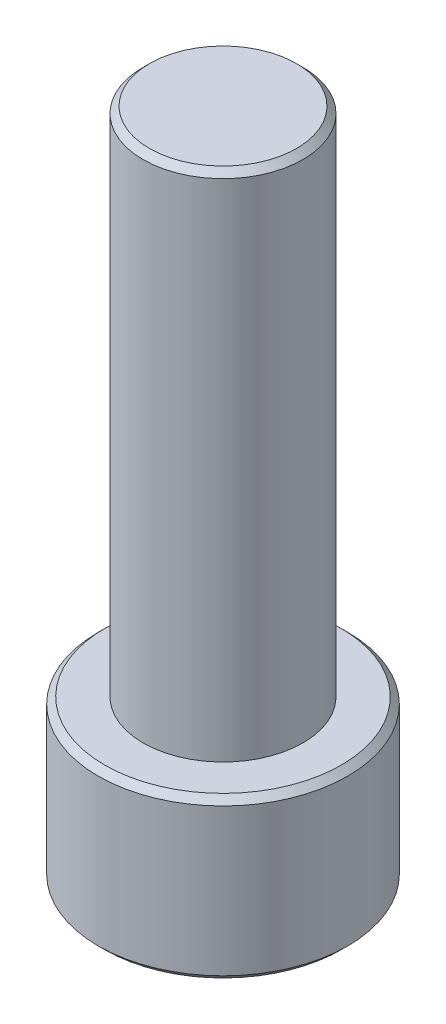
ISO-10303-21;
HEADER;
FILE_DESCRIPTION(('STEP AP214'),'2;1');
FILE_NAME('part.step','',(''),(''),'','','');
FILE_SCHEMA(('AUTOMOTIVE_DESIGN { 1 0 10303 214 1 1 1 1 }'));
ENDSEC;
DATA;
#1=APPLICATION_CONTEXT('core data for automotive mechanical design processes');
#2=APPLICATION_PROTOCOL_DEFINITION('international standard','automotive_design',2000,#1);
#3=PRODUCT_CONTEXT('',#1,'mechanical');
#4=PRODUCT('Part','Part','',(#3));
#5=PRODUCT_RELATED_PRODUCT_CATEGORY('part','',(#4));
#6=PRODUCT_DEFINITION_FORMATION('','',#4);
#7=PRODUCT_DEFINITION_CONTEXT('part definition',#1,'design');
#8=PRODUCT_DEFINITION('design','',#6,#7);
#9=PRODUCT_DEFINITION_SHAPE('','',#8);
#10=(LENGTH_UNIT() NAMED_UNIT(*) SI_UNIT(.MILLI.,.METRE.));
#11=(NAMED_UNIT(*) PLANE_ANGLE_UNIT() SI_UNIT($,.RADIAN.));
#12=(NAMED_UNIT(*) SI_UNIT($,.STERADIAN.) SOLID_ANGLE_UNIT());
#13=UNCERTAINTY_MEASURE_WITH_UNIT(LENGTH_MEASURE(1.E-05),#10,'distance_accuracy_value','');
#14=(GEOMETRIC_REPRESENTATION_CONTEXT(3) GLOBAL_UNCERTAINTY_ASSIGNED_CONTEXT((#13)) GLOBAL_UNIT_ASSIGNED_CONTEXT((#10,
#11,#12)) REPRESENTATION_CONTEXT('',''));
#15=CARTESIAN_POINT('',(0.,0.,0.));
#16=DIRECTION('',(0.,0.,1.));
#17=DIRECTION('',(1.,0.,0.));
#18=AXIS2_PLACEMENT_3D('',#15,#16,#17);
#19=CARTESIAN_POINT('',(0.,0.,0.));
#20=DIRECTION('',(0.,1.,0.));
#21=DIRECTION('',(0.,0.,1.));
#22=AXIS2_PLACEMENT_3D('',#19,#20,#21);
#23=PLANE('',#22);
#24=CARTESIAN_POINT('',(0.,0.,0.));
#25=DIRECTION('',(0.,1.,0.));
#26=DIRECTION('',(0.,0.,1.));
#27=AXIS2_PLACEMENT_3D('',#24,#25,#26);
#28=CIRCLE('',#27,1.85);
#29=CARTESIAN_POINT('',(0.,0.,1.85));
#30=VERTEX_POINT('',#29);
#31=EDGE_CURVE('E153',#30,#30,#28,.T.);
#32=ORIENTED_EDGE('',*,*,#31,.T.);
#33=EDGE_LOOP('',(#32));
#34=FACE_BOUND('',#33,.T.);
#35=CARTESIAN_POINT('',(0.,0.,0.));
#36=DIRECTION('',(0.,1.,0.));
#37=DIRECTION('',(0.,0.,1.));
#38=AXIS2_PLACEMENT_3D('',#35,#36,#37);
#39=CIRCLE('',#38,1.25);
#40=CARTESIAN_POINT('',(0.,0.,1.25));
#41=VERTEX_POINT('',#40);
#42=EDGE_CURVE('E139',#41,#41,#39,.T.);
#43=ORIENTED_EDGE('',*,*,#42,.F.);
#44=EDGE_LOOP('',(#43));
#45=FACE_BOUND('',#44,.T.);
#46=ADVANCED_FACE('F37',(#34,#45),#23,.T.);
#47=CARTESIAN_POINT('',(0.,-2.5,0.));
#48=DIRECTION('',(0.,1.,0.));
#49=DIRECTION('',(0.,0.,1.));
#50=AXIS2_PLACEMENT_3D('',#47,#48,#49);
#51=CYLINDRICAL_SURFACE('',#50,1.95);
#52=CARTESIAN_POINT('',(0.,-0.099999999999999,0.));
#53=DIRECTION('',(0.,1.,0.));
#54=DIRECTION('',(0.,0.,1.));
#55=AXIS2_PLACEMENT_3D('',#52,#53,#54);
#56=CIRCLE('',#55,1.95);
#57=CARTESIAN_POINT('',(0.,-0.099999999999999,1.95));
#58=VERTEX_POINT('',#57);
#59=EDGE_CURVE('E45',#58,#58,#56,.F.);
#60=ORIENTED_EDGE('',*,*,#59,.T.);
#61=EDGE_LOOP('',(#60));
#62=FACE_BOUND('',#61,.T.);
#63=CARTESIAN_POINT('',(0.,-2.4,0.));
#64=DIRECTION('',(0.,1.,0.));
#65=DIRECTION('',(0.,0.,1.));
#66=AXIS2_PLACEMENT_3D('',#63,#64,#65);
#67=CIRCLE('',#66,1.95);
#68=CARTESIAN_POINT('',(0.,-2.4,1.95));
#69=VERTEX_POINT('',#68);
#70=EDGE_CURVE('E156',#69,#69,#67,.T.);
#71=ORIENTED_EDGE('',*,*,#70,.T.);
#72=EDGE_LOOP('',(#71));
#73=FACE_BOUND('',#72,.T.);
#74=ADVANCED_FACE('F161',(#62,#73),#51,.T.);
#75=CARTESIAN_POINT('',(0.,-2.5,0.));
#76=DIRECTION('',(0.,1.,0.));
#77=DIRECTION('',(0.,0.,1.));
#78=AXIS2_PLACEMENT_3D('',#75,#76,#77);
#79=PLANE('',#78);
#80=CARTESIAN_POINT('',(0.,-2.5,0.));
#81=DIRECTION('',(0.,1.,0.));
#82=DIRECTION('',(0.,0.,1.));
#83=AXIS2_PLACEMENT_3D('',#80,#81,#82);
#84=CIRCLE('',#83,1.85);
#85=CARTESIAN_POINT('',(0.,-2.5,1.85));
#86=VERTEX_POINT('',#85);
#87=EDGE_CURVE('E11',#86,#86,#84,.F.);
#88=ORIENTED_EDGE('',*,*,#87,.T.);
#89=EDGE_LOOP('',(#88));
#90=FACE_BOUND('',#89,.T.);
#91=DIRECTION('',(0.866025403784439,0.,0.5));
#92=VECTOR('',#91,1.);
#93=CARTESIAN_POINT('',(-0.999999999999999,-2.5,0.577350269189626));
#94=LINE('',#93,#92);
#95=CARTESIAN_POINT('',(-0.999999999999999,-2.5,0.577350269189626));
#96=VERTEX_POINT('',#95);
#97=CARTESIAN_POINT('',(0.,-2.5,1.15470053837925));
#98=VERTEX_POINT('',#97);
#99=EDGE_CURVE('E114',#96,#98,#94,.T.);
#100=ORIENTED_EDGE('',*,*,#99,.T.);
#101=DIRECTION('',(0.866025403784439,0.,-0.5));
#102=VECTOR('',#101,1.);
#103=CARTESIAN_POINT('',(0.,-2.5,1.15470053837925));
#104=LINE('',#103,#102);
#105=CARTESIAN_POINT('',(0.999999999999999,-2.5,0.577350269189626));
#106=VERTEX_POINT('',#105);
#107=EDGE_CURVE('E137',#98,#106,#104,.T.);
#108=ORIENTED_EDGE('',*,*,#107,.T.);
#109=DIRECTION('',(0.,0.,-1.));
#110=VECTOR('',#109,1.);
#111=CARTESIAN_POINT('',(0.999999999999999,-2.5,0.577350269189626));
#112=LINE('',#111,#110);
#113=CARTESIAN_POINT('',(0.999999999999999,-2.5,-0.577350269189627));
#114=VERTEX_POINT('',#113);
#115=EDGE_CURVE('E119',#106,#114,#112,.T.);
#116=ORIENTED_EDGE('',*,*,#115,.T.);
#117=DIRECTION('',(-0.866025403784439,0.,-0.5));
#118=VECTOR('',#117,1.);
#119=CARTESIAN_POINT('',(0.999999999999999,-2.5,-0.577350269189627));
#120=LINE('',#119,#118);
#121=CARTESIAN_POINT('',(0.,-2.5,-1.15470053837925));
#122=VERTEX_POINT('',#121);
#123=EDGE_CURVE('E52',#114,#122,#120,.T.);
#124=ORIENTED_EDGE('',*,*,#123,.T.);
#125=DIRECTION('',(-0.866025403784439,0.,0.5));
#126=VECTOR('',#125,1.);
#127=CARTESIAN_POINT('',(0.,-2.5,-1.15470053837925));
#128=LINE('',#127,#126);
#129=CARTESIAN_POINT('',(-1.,-2.5,-0.577350269189626));
#130=VERTEX_POINT('',#129);
#131=EDGE_CURVE('E100',#122,#130,#128,.T.);
#132=ORIENTED_EDGE('',*,*,#131,.T.);
#133=DIRECTION('',(0.,0.,1.));
#134=VECTOR('',#133,1.);
#135=CARTESIAN_POINT('',(-1.,-2.5,-0.577350269189626));
#136=LINE('',#135,#134);
#137=EDGE_CURVE('E110',#130,#96,#136,.T.);
#138=ORIENTED_EDGE('',*,*,#137,.T.);
#139=EDGE_LOOP('',(#100,#108,#116,#124,#132,#138));
#140=FACE_BOUND('',#139,.T.);
#141=ADVANCED_FACE('F116',(#90,#140),#79,.F.);
#142=CARTESIAN_POINT('',(0.,8.,0.));
#143=DIRECTION('',(0.,-1.,0.));
#144=DIRECTION('',(0.,0.,-1.));
#145=AXIS2_PLACEMENT_3D('',#142,#143,#144);
#146=CYLINDRICAL_SURFACE('',#145,1.25);
#147=CARTESIAN_POINT('',(0.,7.9,0.));
#148=DIRECTION('',(0.,1.,0.));
#149=DIRECTION('',(0.,0.,1.));
#150=AXIS2_PLACEMENT_3D('',#147,#148,#149);
#151=CIRCLE('',#150,1.25);
#152=CARTESIAN_POINT('',(0.,7.9,1.25));
#153=VERTEX_POINT('',#152);
#154=EDGE_CURVE('E150',#153,#153,#151,.F.);
#155=ORIENTED_EDGE('',*,*,#154,.T.);
#156=EDGE_LOOP('',(#155));
#157=FACE_BOUND('',#156,.T.);
#158=ORIENTED_EDGE('',*,*,#42,.T.);
#159=EDGE_LOOP('',(#158));
#160=FACE_BOUND('',#159,.T.);
#161=ADVANCED_FACE('F175',(#157,#160),#146,.T.);
#162=CARTESIAN_POINT('',(0.,8.,0.));
#163=DIRECTION('',(0.,1.,0.));
#164=DIRECTION('',(0.,0.,1.));
#165=AXIS2_PLACEMENT_3D('',#162,#163,#164);
#166=PLANE('',#165);
#167=CARTESIAN_POINT('',(0.,8.,0.));
#168=DIRECTION('',(0.,1.,0.));
#169=DIRECTION('',(0.,0.,1.));
#170=AXIS2_PLACEMENT_3D('',#167,#168,#169);
#171=CIRCLE('',#170,1.15);
#172=CARTESIAN_POINT('',(0.,8.,1.15));
#173=VERTEX_POINT('',#172);
#174=EDGE_CURVE('E147',#173,#173,#171,.T.);
#175=ORIENTED_EDGE('',*,*,#174,.T.);
#176=EDGE_LOOP('',(#175));
#177=FACE_BOUND('',#176,.T.);
#178=ADVANCED_FACE('F177',(#177),#166,.T.);
#179=CARTESIAN_POINT('',(0.,-2.5,1.15470053837925));
#180=DIRECTION('',(0.5,0.,0.866025403784439));
#181=DIRECTION('',(0.866025403784439,0.,-0.5));
#182=AXIS2_PLACEMENT_3D('',#179,#180,#181);
#183=PLANE('',#182);
#184=DIRECTION('',(0.866025403784439,0.,-0.5));
#185=VECTOR('',#184,1.);
#186=CARTESIAN_POINT('',(0.,-1.25,1.15470053837925));
#187=LINE('',#186,#185);
#188=CARTESIAN_POINT('',(0.,-1.25,1.15470053837925));
#189=VERTEX_POINT('',#188);
#190=CARTESIAN_POINT('',(0.999999999999999,-1.25,0.577350269189626));
#191=VERTEX_POINT('',#190);
#192=EDGE_CURVE('E124',#189,#191,#187,.T.);
#193=ORIENTED_EDGE('',*,*,#192,.T.);
#194=DIRECTION('',(0.,1.,0.));
#195=VECTOR('',#194,1.);
#196=CARTESIAN_POINT('',(0.999999999999999,-2.5,0.577350269189626));
#197=LINE('',#196,#195);
#198=EDGE_CURVE('E89',#106,#191,#197,.T.);
#199=ORIENTED_EDGE('',*,*,#198,.F.);
#200=ORIENTED_EDGE('',*,*,#107,.F.);
#201=DIRECTION('',(0.,1.,0.));
#202=VECTOR('',#201,1.);
#203=CARTESIAN_POINT('',(0.,-2.5,1.15470053837925));
#204=LINE('',#203,#202);
#205=EDGE_CURVE('E61',#98,#189,#204,.T.);
#206=ORIENTED_EDGE('',*,*,#205,.T.);
#207=EDGE_LOOP('',(#193,#199,#200,#206));
#208=FACE_BOUND('',#207,.T.);
#209=ADVANCED_FACE('F184',(#208),#183,.F.);
#210=CARTESIAN_POINT('',(-0.999999999999999,-2.5,0.577350269189626));
#211=DIRECTION('',(-0.5,0.,0.866025403784439));
#212=DIRECTION('',(0.866025403784439,0.,0.5));
#213=AXIS2_PLACEMENT_3D('',#210,#211,#212);
#214=PLANE('',#213);
#215=DIRECTION('',(0.866025403784439,0.,0.5));
#216=VECTOR('',#215,1.);
#217=CARTESIAN_POINT('',(-0.999999999999999,-1.25,0.577350269189626));
#218=LINE('',#217,#216);
#219=CARTESIAN_POINT('',(-0.999999999999999,-1.25,0.577350269189626));
#220=VERTEX_POINT('',#219);
#221=EDGE_CURVE('E135',#220,#189,#218,.T.);
#222=ORIENTED_EDGE('',*,*,#221,.T.);
#223=ORIENTED_EDGE('',*,*,#205,.F.);
#224=ORIENTED_EDGE('',*,*,#99,.F.);
#225=DIRECTION('',(0.,1.,0.));
#226=VECTOR('',#225,1.);
#227=CARTESIAN_POINT('',(-0.999999999999999,-2.5,0.577350269189626));
#228=LINE('',#227,#226);
#229=EDGE_CURVE('E106',#96,#220,#228,.T.);
#230=ORIENTED_EDGE('',*,*,#229,.T.);
#231=EDGE_LOOP('',(#222,#223,#224,#230));
#232=FACE_BOUND('',#231,.T.);
#233=ADVANCED_FACE('F212',(#232),#214,.F.);
#234=CARTESIAN_POINT('',(-1.,-2.5,-0.577350269189626));
#235=DIRECTION('',(-1.,0.,0.));
#236=DIRECTION('',(0.,0.,1.));
#237=AXIS2_PLACEMENT_3D('',#234,#235,#236);
#238=PLANE('',#237);
#239=DIRECTION('',(0.,0.,1.));
#240=VECTOR('',#239,1.);
#241=CARTESIAN_POINT('',(-1.,-1.25,-0.577350269189626));
#242=LINE('',#241,#240);
#243=CARTESIAN_POINT('',(-1.,-1.25,-0.577350269189626));
#244=VERTEX_POINT('',#243);
#245=EDGE_CURVE('E133',#244,#220,#242,.T.);
#246=ORIENTED_EDGE('',*,*,#245,.T.);
#247=ORIENTED_EDGE('',*,*,#229,.F.);
#248=ORIENTED_EDGE('',*,*,#137,.F.);
#249=DIRECTION('',(0.,1.,0.));
#250=VECTOR('',#249,1.);
#251=CARTESIAN_POINT('',(-1.,-2.5,-0.577350269189626));
#252=LINE('',#251,#250);
#253=EDGE_CURVE('E96',#130,#244,#252,.T.);
#254=ORIENTED_EDGE('',*,*,#253,.T.);
#255=EDGE_LOOP('',(#246,#247,#248,#254));
#256=FACE_BOUND('',#255,.T.);
#257=ADVANCED_FACE('F111',(#256),#238,.F.);
#258=CARTESIAN_POINT('',(0.,-2.5,-1.15470053837925));
#259=DIRECTION('',(-0.5,0.,-0.866025403784438));
#260=DIRECTION('',(-0.866025403784438,0.,0.5));
#261=AXIS2_PLACEMENT_3D('',#258,#259,#260);
#262=PLANE('',#261);
#263=DIRECTION('',(-0.866025403784439,0.,0.5));
#264=VECTOR('',#263,1.);
#265=CARTESIAN_POINT('',(0.,-1.25,-1.15470053837925));
#266=LINE('',#265,#264);
#267=CARTESIAN_POINT('',(0.,-1.25,-1.15470053837925));
#268=VERTEX_POINT('',#267);
#269=EDGE_CURVE('E102',#268,#244,#266,.T.);
#270=ORIENTED_EDGE('',*,*,#269,.T.);
#271=ORIENTED_EDGE('',*,*,#253,.F.);
#272=ORIENTED_EDGE('',*,*,#131,.F.);
#273=DIRECTION('',(0.,1.,0.));
#274=VECTOR('',#273,1.);
#275=CARTESIAN_POINT('',(0.,-2.5,-1.15470053837925));
#276=LINE('',#275,#274);
#277=EDGE_CURVE('E107',#122,#268,#276,.T.);
#278=ORIENTED_EDGE('',*,*,#277,.T.);
#279=EDGE_LOOP('',(#270,#271,#272,#278));
#280=FACE_BOUND('',#279,.T.);
#281=ADVANCED_FACE('F98',(#280),#262,.F.);
#282=CARTESIAN_POINT('',(0.999999999999999,-2.5,-0.577350269189627));
#283=DIRECTION('',(0.5,0.,-0.866025403784439));
#284=DIRECTION('',(-0.866025403784439,0.,-0.5));
#285=AXIS2_PLACEMENT_3D('',#282,#283,#284);
#286=PLANE('',#285);
#287=DIRECTION('',(-0.866025403784439,0.,-0.5));
#288=VECTOR('',#287,1.);
#289=CARTESIAN_POINT('',(0.999999999999999,-1.25,-0.577350269189627));
#290=LINE('',#289,#288);
#291=CARTESIAN_POINT('',(0.999999999999999,-1.25,-0.577350269189627));
#292=VERTEX_POINT('',#291);
#293=EDGE_CURVE('E129',#292,#268,#290,.T.);
#294=ORIENTED_EDGE('',*,*,#293,.T.);
#295=ORIENTED_EDGE('',*,*,#277,.F.);
#296=ORIENTED_EDGE('',*,*,#123,.F.);
#297=DIRECTION('',(0.,1.,0.));
#298=VECTOR('',#297,1.);
#299=CARTESIAN_POINT('',(0.999999999999999,-2.5,-0.577350269189627));
#300=LINE('',#299,#298);
#301=EDGE_CURVE('E142',#114,#292,#300,.T.);
#302=ORIENTED_EDGE('',*,*,#301,.T.);
#303=EDGE_LOOP('',(#294,#295,#296,#302));
#304=FACE_BOUND('',#303,.T.);
#305=ADVANCED_FACE('F208',(#304),#286,.F.);
#306=CARTESIAN_POINT('',(0.999999999999999,-2.5,0.577350269189626));
#307=DIRECTION('',(1.,0.,0.));
#308=DIRECTION('',(0.,0.,-1.));
#309=AXIS2_PLACEMENT_3D('',#306,#307,#308);
#310=PLANE('',#309);
#311=DIRECTION('',(0.,0.,-1.));
#312=VECTOR('',#311,1.);
#313=CARTESIAN_POINT('',(0.999999999999999,-1.25,0.577350269189626));
#314=LINE('',#313,#312);
#315=EDGE_CURVE('E126',#191,#292,#314,.T.);
#316=ORIENTED_EDGE('',*,*,#315,.T.);
#317=ORIENTED_EDGE('',*,*,#301,.F.);
#318=ORIENTED_EDGE('',*,*,#115,.F.);
#319=ORIENTED_EDGE('',*,*,#198,.T.);
#320=EDGE_LOOP('',(#316,#317,#318,#319));
#321=FACE_BOUND('',#320,.T.);
#322=ADVANCED_FACE('F199',(#321),#310,.F.);
#323=CARTESIAN_POINT('',(0.,-1.25,0.));
#324=DIRECTION('',(0.,1.,0.));
#325=DIRECTION('',(0.,0.,1.));
#326=AXIS2_PLACEMENT_3D('',#323,#324,#325);
#327=PLANE('',#326);
#328=ORIENTED_EDGE('',*,*,#192,.F.);
#329=ORIENTED_EDGE('',*,*,#221,.F.);
#330=ORIENTED_EDGE('',*,*,#245,.F.);
#331=ORIENTED_EDGE('',*,*,#269,.F.);
#332=ORIENTED_EDGE('',*,*,#293,.F.);
#333=ORIENTED_EDGE('',*,*,#315,.F.);
#334=EDGE_LOOP('',(#328,#329,#330,#331,#332,#333));
#335=FACE_BOUND('',#334,.T.);
#336=ADVANCED_FACE('F194',(#335),#327,.F.);
#337=CARTESIAN_POINT('',(0.,8.,0.));
#338=DIRECTION('',(0.,-1.,0.));
#339=DIRECTION('',(0.,0.,-1.));
#340=AXIS2_PLACEMENT_3D('',#337,#338,#339);
#341=CONICAL_SURFACE('',#340,1.15,0.785398163397443);
#342=ORIENTED_EDGE('',*,*,#154,.F.);
#343=EDGE_LOOP('',(#342));
#344=FACE_BOUND('',#343,.T.);
#345=ORIENTED_EDGE('',*,*,#174,.F.);
#346=EDGE_LOOP('',(#345));
#347=FACE_BOUND('',#346,.T.);
#348=ADVANCED_FACE('F167',(#344,#347),#341,.T.);
#349=CARTESIAN_POINT('',(0.,0.,0.));
#350=DIRECTION('',(0.,-1.,0.));
#351=DIRECTION('',(0.,0.,-1.));
#352=AXIS2_PLACEMENT_3D('',#349,#350,#351);
#353=CONICAL_SURFACE('',#352,1.85,0.785398163397447);
#354=ORIENTED_EDGE('',*,*,#59,.F.);
#355=EDGE_LOOP('',(#354));
#356=FACE_BOUND('',#355,.T.);
#357=ORIENTED_EDGE('',*,*,#31,.F.);
#358=EDGE_LOOP('',(#357));
#359=FACE_BOUND('',#358,.T.);
#360=ADVANCED_FACE('F164',(#356,#359),#353,.T.);
#361=CARTESIAN_POINT('',(0.,-2.4,0.));
#362=DIRECTION('',(0.,1.,0.));
#363=DIRECTION('',(0.,0.,1.));
#364=AXIS2_PLACEMENT_3D('',#361,#362,#363);
#365=CONICAL_SURFACE('',#364,1.95,0.785398163397449);
#366=ORIENTED_EDGE('',*,*,#87,.F.);
#367=EDGE_LOOP('',(#366));
#368=FACE_BOUND('',#367,.T.);
#369=ORIENTED_EDGE('',*,*,#70,.F.);
#370=EDGE_LOOP('',(#369));
#371=FACE_BOUND('',#370,.T.);
#372=ADVANCED_FACE('F39',(#368,#371),#365,.T.);
#373=CLOSED_SHELL('',(#46,#74,#141,#161,#178,#209,#233,#257,#281,#305,#322,#336,#348,#360,#372));
#374=MANIFOLD_SOLID_BREP('B2',#373);
#375=ADVANCED_BREP_SHAPE_REPRESENTATION('',(#18,#374),#14);
#376=SHAPE_DEFINITION_REPRESENTATION(#9,#375);
ENDSEC;
END-ISO-10303-21;
